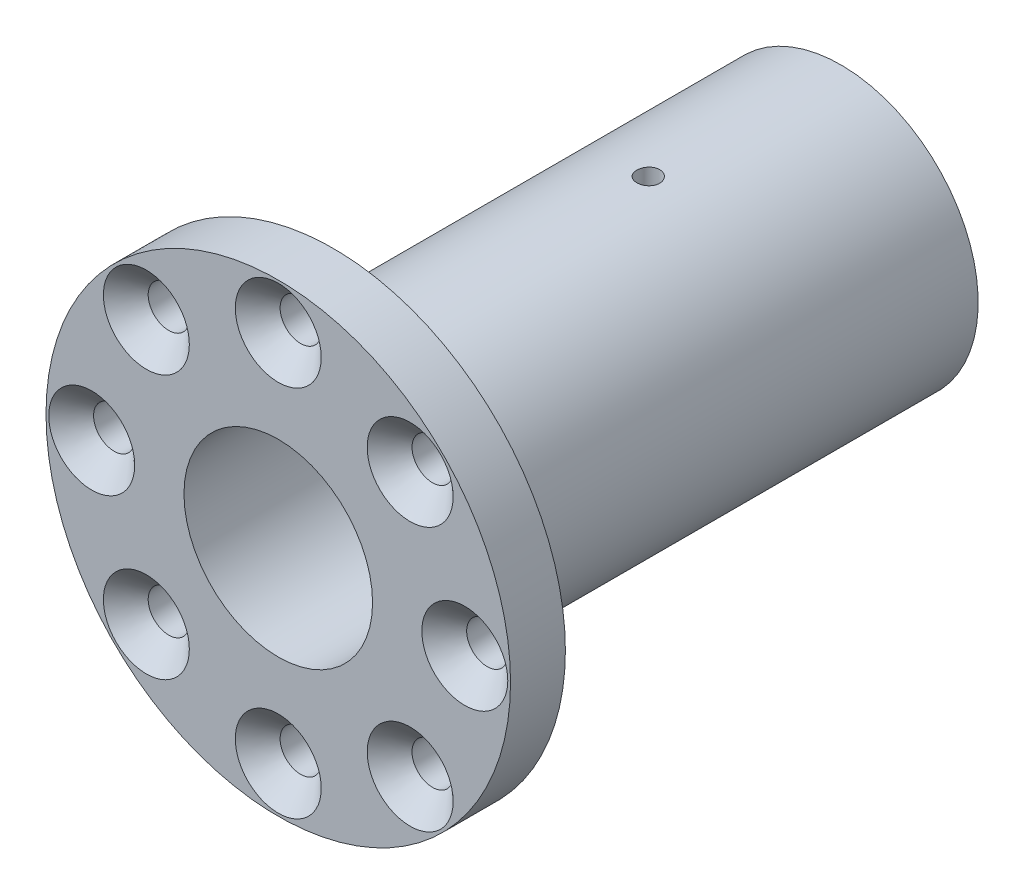
ISO-10303-21;
HEADER;
FILE_DESCRIPTION(('STEP AP214'),'2;1');
FILE_NAME('part.step','',(''),(''),'','','');
FILE_SCHEMA(('AUTOMOTIVE_DESIGN { 1 0 10303 214 1 1 1 1 }'));
ENDSEC;
DATA;
#1=APPLICATION_CONTEXT('core data for automotive mechanical design processes');
#2=APPLICATION_PROTOCOL_DEFINITION('international standard','automotive_design',2000,#1);
#3=PRODUCT_CONTEXT('',#1,'mechanical');
#4=PRODUCT('Part','Part','',(#3));
#5=PRODUCT_RELATED_PRODUCT_CATEGORY('part','',(#4));
#6=PRODUCT_DEFINITION_FORMATION('','',#4);
#7=PRODUCT_DEFINITION_CONTEXT('part definition',#1,'design');
#8=PRODUCT_DEFINITION('design','',#6,#7);
#9=PRODUCT_DEFINITION_SHAPE('','',#8);
#10=(LENGTH_UNIT() NAMED_UNIT(*) SI_UNIT(.MILLI.,.METRE.));
#11=(NAMED_UNIT(*) PLANE_ANGLE_UNIT() SI_UNIT($,.RADIAN.));
#12=(NAMED_UNIT(*) SI_UNIT($,.STERADIAN.) SOLID_ANGLE_UNIT());
#13=UNCERTAINTY_MEASURE_WITH_UNIT(LENGTH_MEASURE(1.E-05),#10,'distance_accuracy_value','');
#14=(GEOMETRIC_REPRESENTATION_CONTEXT(3) GLOBAL_UNCERTAINTY_ASSIGNED_CONTEXT((#13)) GLOBAL_UNIT_ASSIGNED_CONTEXT((#10,
#11,#12)) REPRESENTATION_CONTEXT('',''));
#15=CARTESIAN_POINT('',(0.,0.,0.));
#16=DIRECTION('',(0.,0.,1.));
#17=DIRECTION('',(1.,0.,0.));
#18=AXIS2_PLACEMENT_3D('',#15,#16,#17);
#19=CARTESIAN_POINT('',(-2.5,6.53834841531101,61.54));
#20=DIRECTION('',(-1.,0.,0.));
#21=DIRECTION('',(0.,0.,1.));
#22=AXIS2_PLACEMENT_3D('',#19,#20,#21);
#23=PLANE('',#22);
#24=DIRECTION('',(0.,1.,0.));
#25=VECTOR('',#24,1.);
#26=CARTESIAN_POINT('',(-2.5,6.53834841531101,23.44));
#27=LINE('',#26,#25);
#28=CARTESIAN_POINT('',(-2.5,6.54948151841044,23.44));
#29=VERTEX_POINT('',#28);
#30=CARTESIAN_POINT('',(-2.5,9.05849989544415,23.44));
#31=VERTEX_POINT('',#30);
#32=EDGE_CURVE('E76',#29,#31,#27,.T.);
#33=ORIENTED_EDGE('',*,*,#32,.F.);
#34=DIRECTION('',(0.,0.,-1.));
#35=VECTOR('',#34,1.);
#36=CARTESIAN_POINT('',(-2.5,6.54948151841044,61.54));
#37=LINE('',#36,#35);
#38=CARTESIAN_POINT('',(-2.5,6.54948151841044,0.));
#39=VERTEX_POINT('',#38);
#40=EDGE_CURVE('E81',#29,#39,#37,.T.);
#41=ORIENTED_EDGE('',*,*,#40,.T.);
#42=DIRECTION('',(0.,1.,0.));
#43=VECTOR('',#42,1.);
#44=CARTESIAN_POINT('',(-2.5,6.53834841531101,0.));
#45=LINE('',#44,#43);
#46=CARTESIAN_POINT('',(-2.5,9.05849989544415,0.));
#47=VERTEX_POINT('',#46);
#48=EDGE_CURVE('E89',#39,#47,#45,.T.);
#49=ORIENTED_EDGE('',*,*,#48,.T.);
#50=DIRECTION('',(0.,0.,-1.));
#51=VECTOR('',#50,1.);
#52=CARTESIAN_POINT('',(-2.5,9.05849989544415,61.54));
#53=LINE('',#52,#51);
#54=EDGE_CURVE('E57',#31,#47,#53,.T.);
#55=ORIENTED_EDGE('',*,*,#54,.F.);
#56=EDGE_LOOP('',(#33,#41,#49,#55));
#57=FACE_BOUND('',#56,.T.);
#58=ADVANCED_FACE('F35',(#57),#23,.F.);
#59=CARTESIAN_POINT('',(2.5,9.05849989544415,61.54));
#60=DIRECTION('',(1.,0.,0.));
#61=DIRECTION('',(0.,1.,0.));
#62=AXIS2_PLACEMENT_3D('',#59,#60,#61);
#63=PLANE('',#62);
#64=DIRECTION('',(0.,-1.,0.));
#65=VECTOR('',#64,1.);
#66=CARTESIAN_POINT('',(2.5,9.05849989544415,23.44));
#67=LINE('',#66,#65);
#68=CARTESIAN_POINT('',(2.5,9.05849989544415,23.44));
#69=VERTEX_POINT('',#68);
#70=CARTESIAN_POINT('',(2.5,6.54948151841044,23.44));
#71=VERTEX_POINT('',#70);
#72=EDGE_CURVE('E49',#69,#71,#67,.T.);
#73=ORIENTED_EDGE('',*,*,#72,.F.);
#74=DIRECTION('',(0.,0.,-1.));
#75=VECTOR('',#74,1.);
#76=CARTESIAN_POINT('',(2.5,9.05849989544415,61.54));
#77=LINE('',#76,#75);
#78=CARTESIAN_POINT('',(2.5,9.05849989544415,0.));
#79=VERTEX_POINT('',#78);
#80=EDGE_CURVE('E101',#69,#79,#77,.T.);
#81=ORIENTED_EDGE('',*,*,#80,.T.);
#82=DIRECTION('',(0.,-1.,0.));
#83=VECTOR('',#82,1.);
#84=CARTESIAN_POINT('',(2.5,9.05849989544415,0.));
#85=LINE('',#84,#83);
#86=CARTESIAN_POINT('',(2.5,6.54948151841044,0.));
#87=VERTEX_POINT('',#86);
#88=EDGE_CURVE('E98',#79,#87,#85,.T.);
#89=ORIENTED_EDGE('',*,*,#88,.T.);
#90=DIRECTION('',(0.,0.,-1.));
#91=VECTOR('',#90,1.);
#92=CARTESIAN_POINT('',(2.5,6.54948151841044,61.54));
#93=LINE('',#92,#91);
#94=EDGE_CURVE('E43',#87,#71,#93,.F.);
#95=ORIENTED_EDGE('',*,*,#94,.T.);
#96=EDGE_LOOP('',(#73,#81,#89,#95));
#97=FACE_BOUND('',#96,.T.);
#98=ADVANCED_FACE('F192',(#97),#63,.F.);
#99=CARTESIAN_POINT('',(-2.5,9.05849989544415,61.54));
#100=DIRECTION('',(0.,1.,0.));
#101=DIRECTION('',(0.,0.,1.));
#102=AXIS2_PLACEMENT_3D('',#99,#100,#101);
#103=PLANE('',#102);
#104=CARTESIAN_POINT('',(0.,9.05849989544415,21.082));
#105=DIRECTION('',(0.,-1.,0.));
#106=DIRECTION('',(0.,0.,-1.));
#107=AXIS2_PLACEMENT_3D('',#104,#105,#106);
#108=CIRCLE('',#107,1.24999999999999);
#109=CARTESIAN_POINT('',(0.,9.05849989544415,19.832));
#110=VERTEX_POINT('',#109);
#111=EDGE_CURVE('E125',#110,#110,#108,.T.);
#112=ORIENTED_EDGE('',*,*,#111,.F.);
#113=EDGE_LOOP('',(#112));
#114=FACE_BOUND('',#113,.T.);
#115=DIRECTION('',(1.,0.,0.));
#116=VECTOR('',#115,1.);
#117=CARTESIAN_POINT('',(-2.5,9.05849989544415,23.44));
#118=LINE('',#117,#116);
#119=EDGE_CURVE('E83',#31,#69,#118,.T.);
#120=ORIENTED_EDGE('',*,*,#119,.F.);
#121=ORIENTED_EDGE('',*,*,#54,.T.);
#122=DIRECTION('',(1.,0.,0.));
#123=VECTOR('',#122,1.);
#124=CARTESIAN_POINT('',(-2.5,9.05849989544415,0.));
#125=LINE('',#124,#123);
#126=EDGE_CURVE('E91',#47,#79,#125,.T.);
#127=ORIENTED_EDGE('',*,*,#126,.T.);
#128=ORIENTED_EDGE('',*,*,#80,.F.);
#129=EDGE_LOOP('',(#120,#121,#127,#128));
#130=FACE_BOUND('',#129,.T.);
#131=ADVANCED_FACE('F191',(#114,#130),#103,.F.);
#132=CARTESIAN_POINT('',(0.,0.,61.54));
#133=DIRECTION('',(0.,0.,-1.));
#134=DIRECTION('',(-1.,0.,0.));
#135=AXIS2_PLACEMENT_3D('',#132,#133,#134);
#136=CYLINDRICAL_SURFACE('',#135,7.01039999999999);
#137=CARTESIAN_POINT('',(0.,0.,23.44));
#138=DIRECTION('',(0.,0.,1.));
#139=DIRECTION('',(1.,0.,0.));
#140=AXIS2_PLACEMENT_3D('',#137,#138,#139);
#141=CIRCLE('',#140,7.01039999999999);
#142=EDGE_CURVE('E11',#71,#29,#141,.F.);
#143=ORIENTED_EDGE('',*,*,#142,.F.);
#144=ORIENTED_EDGE('',*,*,#94,.F.);
#145=CARTESIAN_POINT('',(0.,0.,0.));
#146=DIRECTION('',(0.,0.,-1.));
#147=DIRECTION('',(-1.,0.,0.));
#148=AXIS2_PLACEMENT_3D('',#145,#146,#147);
#149=CIRCLE('',#148,7.01039999999999);
#150=EDGE_CURVE('E87',#87,#39,#149,.T.);
#151=ORIENTED_EDGE('',*,*,#150,.T.);
#152=ORIENTED_EDGE('',*,*,#40,.F.);
#153=EDGE_LOOP('',(#143,#144,#151,#152));
#154=FACE_BOUND('',#153,.T.);
#155=ADVANCED_FACE('F85',(#154),#136,.F.);
#156=CARTESIAN_POINT('',(0.,0.,61.54));
#157=DIRECTION('',(0.,0.,-1.));
#158=DIRECTION('',(-1.,0.,0.));
#159=AXIS2_PLACEMENT_3D('',#156,#157,#158);
#160=CYLINDRICAL_SURFACE('',#159,25.4);
#161=CARTESIAN_POINT('',(0.,0.,61.54));
#162=DIRECTION('',(0.,0.,-1.));
#163=DIRECTION('',(-1.,0.,0.));
#164=AXIS2_PLACEMENT_3D('',#161,#162,#163);
#165=CIRCLE('',#164,25.4);
#166=CARTESIAN_POINT('',(-25.4,0.,61.54));
#167=VERTEX_POINT('',#166);
#168=EDGE_CURVE('E113',#167,#167,#165,.T.);
#169=ORIENTED_EDGE('',*,*,#168,.T.);
#170=EDGE_LOOP('',(#169));
#171=FACE_BOUND('',#170,.T.);
#172=CARTESIAN_POINT('',(0.,0.,55.54));
#173=DIRECTION('',(0.,0.,-1.));
#174=DIRECTION('',(-1.,0.,0.));
#175=AXIS2_PLACEMENT_3D('',#172,#173,#174);
#176=CIRCLE('',#175,25.4);
#177=CARTESIAN_POINT('',(-25.4,0.,55.54));
#178=VERTEX_POINT('',#177);
#179=EDGE_CURVE('E108',#178,#178,#176,.T.);
#180=ORIENTED_EDGE('',*,*,#179,.F.);
#181=EDGE_LOOP('',(#180));
#182=FACE_BOUND('',#181,.T.);
#183=ADVANCED_FACE('F37',(#171,#182),#160,.T.);
#184=CARTESIAN_POINT('',(25.4,0.,61.54));
#185=DIRECTION('',(0.,0.,1.));
#186=DIRECTION('',(1.,0.,0.));
#187=AXIS2_PLACEMENT_3D('',#184,#185,#186);
#188=PLANE('',#187);
#189=CARTESIAN_POINT('',(0.,0.,61.54));
#190=DIRECTION('',(0.,0.,1.));
#191=DIRECTION('',(1.,0.,0.));
#192=AXIS2_PLACEMENT_3D('',#189,#190,#191);
#193=CIRCLE('',#192,10.3124);
#194=CARTESIAN_POINT('',(10.3124,0.,61.54));
#195=VERTEX_POINT('',#194);
#196=EDGE_CURVE('E256',#195,#195,#193,.T.);
#197=ORIENTED_EDGE('',*,*,#196,.F.);
#198=EDGE_LOOP('',(#197));
#199=FACE_BOUND('',#198,.T.);
#200=CARTESIAN_POINT('',(0.,20.4,61.54));
#201=DIRECTION('',(0.,0.,1.));
#202=DIRECTION('',(1.,0.,0.));
#203=AXIS2_PLACEMENT_3D('',#200,#201,#202);
#204=CIRCLE('',#203,4.70000000001392);
#205=CARTESIAN_POINT('',(4.70000000001392,20.4,61.54));
#206=VERTEX_POINT('',#205);
#207=EDGE_CURVE('E260',#206,#206,#204,.T.);
#208=ORIENTED_EDGE('',*,*,#207,.F.);
#209=EDGE_LOOP('',(#208));
#210=FACE_BOUND('',#209,.T.);
#211=CARTESIAN_POINT('',(14.4249783362061,14.4249783362068,61.54));
#212=DIRECTION('',(0.,0.,1.));
#213=DIRECTION('',(1.,0.,0.));
#214=AXIS2_PLACEMENT_3D('',#211,#212,#213);
#215=CIRCLE('',#214,4.70000000001391);
#216=CARTESIAN_POINT('',(19.12497833622,14.4249783362068,61.54));
#217=VERTEX_POINT('',#216);
#218=EDGE_CURVE('E264',#217,#217,#215,.T.);
#219=ORIENTED_EDGE('',*,*,#218,.F.);
#220=EDGE_LOOP('',(#219));
#221=FACE_BOUND('',#220,.T.);
#222=CARTESIAN_POINT('',(20.4000000000017,1.73691033767046E-12,61.54));
#223=DIRECTION('',(0.,0.,1.));
#224=DIRECTION('',(1.,0.,0.));
#225=AXIS2_PLACEMENT_3D('',#222,#223,#224);
#226=CIRCLE('',#225,4.70000000001392);
#227=CARTESIAN_POINT('',(25.1000000000156,1.73691033767046E-12,61.54));
#228=VERTEX_POINT('',#227);
#229=EDGE_CURVE('E268',#228,#228,#226,.T.);
#230=ORIENTED_EDGE('',*,*,#229,.F.);
#231=EDGE_LOOP('',(#230));
#232=FACE_BOUND('',#231,.T.);
#233=CARTESIAN_POINT('',(14.4249783362085,-14.4249783362043,61.54));
#234=DIRECTION('',(0.,0.,1.));
#235=DIRECTION('',(1.,0.,0.));
#236=AXIS2_PLACEMENT_3D('',#233,#234,#235);
#237=CIRCLE('',#236,4.70000000001392);
#238=CARTESIAN_POINT('',(19.1249783362224,-14.4249783362043,61.54));
#239=VERTEX_POINT('',#238);
#240=EDGE_CURVE('E272',#239,#239,#237,.T.);
#241=ORIENTED_EDGE('',*,*,#240,.F.);
#242=EDGE_LOOP('',(#241));
#243=FACE_BOUND('',#242,.T.);
#244=CARTESIAN_POINT('',(3.47378376064356E-12,-20.4,61.54));
#245=DIRECTION('',(0.,0.,1.));
#246=DIRECTION('',(1.,0.,0.));
#247=AXIS2_PLACEMENT_3D('',#244,#245,#246);
#248=CIRCLE('',#247,4.70000000001392);
#249=CARTESIAN_POINT('',(4.70000000001739,-20.4,61.54));
#250=VERTEX_POINT('',#249);
#251=EDGE_CURVE('E276',#250,#250,#248,.T.);
#252=ORIENTED_EDGE('',*,*,#251,.F.);
#253=EDGE_LOOP('',(#252));
#254=FACE_BOUND('',#253,.T.);
#255=CARTESIAN_POINT('',(-14.4249783362026,-14.4249783362068,61.54));
#256=DIRECTION('',(0.,0.,1.));
#257=DIRECTION('',(1.,0.,0.));
#258=AXIS2_PLACEMENT_3D('',#255,#256,#257);
#259=CIRCLE('',#258,4.70000000001392);
#260=CARTESIAN_POINT('',(-9.72497833618869,-14.4249783362068,61.54));
#261=VERTEX_POINT('',#260);
#262=EDGE_CURVE('E280',#261,#261,#259,.T.);
#263=ORIENTED_EDGE('',*,*,#262,.F.);
#264=EDGE_LOOP('',(#263));
#265=FACE_BOUND('',#264,.T.);
#266=CARTESIAN_POINT('',(-20.3999999999983,-1.73940861714072E-12,61.54));
#267=DIRECTION('',(0.,0.,1.));
#268=DIRECTION('',(1.,0.,0.));
#269=AXIS2_PLACEMENT_3D('',#266,#267,#268);
#270=CIRCLE('',#269,4.70000000001392);
#271=CARTESIAN_POINT('',(-15.6999999999844,-1.73940861714072E-12,61.54));
#272=VERTEX_POINT('',#271);
#273=EDGE_CURVE('E284',#272,#272,#270,.T.);
#274=ORIENTED_EDGE('',*,*,#273,.F.);
#275=EDGE_LOOP('',(#274));
#276=FACE_BOUND('',#275,.T.);
#277=CARTESIAN_POINT('',(-14.4249783362051,14.4249783362043,61.54));
#278=DIRECTION('',(0.,0.,1.));
#279=DIRECTION('',(1.,0.,0.));
#280=AXIS2_PLACEMENT_3D('',#277,#278,#279);
#281=CIRCLE('',#280,4.70000000001392);
#282=CARTESIAN_POINT('',(-9.72497833619114,14.4249783362043,61.54));
#283=VERTEX_POINT('',#282);
#284=EDGE_CURVE('E287',#283,#283,#281,.T.);
#285=ORIENTED_EDGE('',*,*,#284,.F.);
#286=EDGE_LOOP('',(#285));
#287=FACE_BOUND('',#286,.T.);
#288=ORIENTED_EDGE('',*,*,#168,.F.);
#289=EDGE_LOOP('',(#288));
#290=FACE_BOUND('',#289,.T.);
#291=ADVANCED_FACE('F239',(#199,#210,#221,#232,#243,#254,#265,#276,#287,#290),#188,.T.);
#292=CARTESIAN_POINT('',(0.,0.,55.54));
#293=DIRECTION('',(0.,0.,-1.));
#294=DIRECTION('',(-1.,0.,0.));
#295=AXIS2_PLACEMENT_3D('',#292,#293,#294);
#296=PLANE('',#295);
#297=CARTESIAN_POINT('',(0.,20.4,55.54));
#298=DIRECTION('',(0.,0.,-1.));
#299=DIRECTION('',(-1.,0.,0.));
#300=AXIS2_PLACEMENT_3D('',#297,#298,#299);
#301=CIRCLE('',#300,2.24999999999998);
#302=CARTESIAN_POINT('',(-2.24999999999998,20.4,55.54));
#303=VERTEX_POINT('',#302);
#304=EDGE_CURVE('E424',#303,#303,#301,.T.);
#305=ORIENTED_EDGE('',*,*,#304,.F.);
#306=EDGE_LOOP('',(#305));
#307=FACE_BOUND('',#306,.T.);
#308=CARTESIAN_POINT('',(14.4249783362061,14.4249783362068,55.54));
#309=DIRECTION('',(0.,0.,-1.));
#310=DIRECTION('',(-1.,0.,0.));
#311=AXIS2_PLACEMENT_3D('',#308,#309,#310);
#312=CIRCLE('',#311,2.24999999999998);
#313=CARTESIAN_POINT('',(12.1749783362061,14.4249783362068,55.54));
#314=VERTEX_POINT('',#313);
#315=EDGE_CURVE('E429',#314,#314,#312,.T.);
#316=ORIENTED_EDGE('',*,*,#315,.F.);
#317=EDGE_LOOP('',(#316));
#318=FACE_BOUND('',#317,.T.);
#319=CARTESIAN_POINT('',(20.4000000000017,1.73691033767046E-12,55.54));
#320=DIRECTION('',(0.,0.,-1.));
#321=DIRECTION('',(-1.,0.,0.));
#322=AXIS2_PLACEMENT_3D('',#319,#320,#321);
#323=CIRCLE('',#322,2.24999999999998);
#324=CARTESIAN_POINT('',(18.1500000000018,1.73691033767046E-12,55.54));
#325=VERTEX_POINT('',#324);
#326=EDGE_CURVE('E434',#325,#325,#323,.T.);
#327=ORIENTED_EDGE('',*,*,#326,.F.);
#328=EDGE_LOOP('',(#327));
#329=FACE_BOUND('',#328,.T.);
#330=CARTESIAN_POINT('',(14.4249783362085,-14.4249783362043,55.54));
#331=DIRECTION('',(0.,0.,-1.));
#332=DIRECTION('',(-1.,0.,0.));
#333=AXIS2_PLACEMENT_3D('',#330,#331,#332);
#334=CIRCLE('',#333,2.24999999999998);
#335=CARTESIAN_POINT('',(12.1749783362086,-14.4249783362043,55.54));
#336=VERTEX_POINT('',#335);
#337=EDGE_CURVE('E439',#336,#336,#334,.T.);
#338=ORIENTED_EDGE('',*,*,#337,.F.);
#339=EDGE_LOOP('',(#338));
#340=FACE_BOUND('',#339,.T.);
#341=CARTESIAN_POINT('',(3.47378376064356E-12,-20.4,55.54));
#342=DIRECTION('',(0.,0.,-1.));
#343=DIRECTION('',(-1.,0.,0.));
#344=AXIS2_PLACEMENT_3D('',#341,#342,#343);
#345=CIRCLE('',#344,2.24999999999998);
#346=CARTESIAN_POINT('',(-2.2499999999965,-20.4,55.54));
#347=VERTEX_POINT('',#346);
#348=EDGE_CURVE('E444',#347,#347,#345,.T.);
#349=ORIENTED_EDGE('',*,*,#348,.F.);
#350=EDGE_LOOP('',(#349));
#351=FACE_BOUND('',#350,.T.);
#352=CARTESIAN_POINT('',(-14.4249783362026,-14.4249783362068,55.54));
#353=DIRECTION('',(0.,0.,-1.));
#354=DIRECTION('',(-1.,0.,0.));
#355=AXIS2_PLACEMENT_3D('',#352,#353,#354);
#356=CIRCLE('',#355,2.24999999999998);
#357=CARTESIAN_POINT('',(-16.6749783362026,-14.4249783362068,55.54));
#358=VERTEX_POINT('',#357);
#359=EDGE_CURVE('E448',#358,#358,#356,.T.);
#360=ORIENTED_EDGE('',*,*,#359,.F.);
#361=EDGE_LOOP('',(#360));
#362=FACE_BOUND('',#361,.T.);
#363=CARTESIAN_POINT('',(-20.3999999999983,-1.73940861714072E-12,55.54));
#364=DIRECTION('',(0.,0.,-1.));
#365=DIRECTION('',(-1.,0.,0.));
#366=AXIS2_PLACEMENT_3D('',#363,#364,#365);
#367=CIRCLE('',#366,2.24999999999998);
#368=CARTESIAN_POINT('',(-22.6499999999982,-1.73940861714072E-12,55.54));
#369=VERTEX_POINT('',#368);
#370=EDGE_CURVE('E290',#369,#369,#367,.T.);
#371=ORIENTED_EDGE('',*,*,#370,.F.);
#372=EDGE_LOOP('',(#371));
#373=FACE_BOUND('',#372,.T.);
#374=CARTESIAN_POINT('',(-14.4249783362051,14.4249783362043,55.54));
#375=DIRECTION('',(0.,0.,-1.));
#376=DIRECTION('',(-1.,0.,0.));
#377=AXIS2_PLACEMENT_3D('',#374,#375,#376);
#378=CIRCLE('',#377,2.24999999999998);
#379=CARTESIAN_POINT('',(-16.674978336205,14.4249783362043,55.54));
#380=VERTEX_POINT('',#379);
#381=EDGE_CURVE('E126',#380,#380,#378,.T.);
#382=ORIENTED_EDGE('',*,*,#381,.F.);
#383=EDGE_LOOP('',(#382));
#384=FACE_BOUND('',#383,.T.);
#385=CARTESIAN_POINT('',(0.,0.,55.54));
#386=DIRECTION('',(0.,0.,-1.));
#387=DIRECTION('',(-1.,0.,0.));
#388=AXIS2_PLACEMENT_3D('',#385,#386,#387);
#389=CIRCLE('',#388,15.);
#390=CARTESIAN_POINT('',(-15.,0.,55.54));
#391=VERTEX_POINT('',#390);
#392=EDGE_CURVE('E103',#391,#391,#389,.T.);
#393=ORIENTED_EDGE('',*,*,#392,.F.);
#394=EDGE_LOOP('',(#393));
#395=FACE_BOUND('',#394,.T.);
#396=ORIENTED_EDGE('',*,*,#179,.T.);
#397=EDGE_LOOP('',(#396));
#398=FACE_BOUND('',#397,.T.);
#399=ADVANCED_FACE('F205',(#307,#318,#329,#340,#351,#362,#373,#384,#395,#398),#296,.T.);
#400=CARTESIAN_POINT('',(0.,0.,0.));
#401=DIRECTION('',(0.,0.,1.));
#402=DIRECTION('',(1.,0.,0.));
#403=AXIS2_PLACEMENT_3D('',#400,#401,#402);
#404=CYLINDRICAL_SURFACE('',#403,15.);
#405=CARTESIAN_POINT('',(0.,15.,19.832));
#406=CARTESIAN_POINT('',(0.0700826124015046,14.999999317644,19.8320030610329));
#407=CARTESIAN_POINT('',(0.140212933975281,14.9995036067925,19.8379137122638));
#408=CARTESIAN_POINT('',(0.278533213375484,14.9975737791031,19.8614054398189));
#409=CARTESIAN_POINT('',(0.346720881531534,14.9961385991462,19.8789997378811));
#410=CARTESIAN_POINT('',(0.479132528142821,14.9924920155763,19.9253464422617));
#411=CARTESIAN_POINT('',(0.543358725530763,14.9902810512311,19.9540925351373));
#412=CARTESIAN_POINT('',(0.666059041770088,14.9853308468089,20.02191553984));
#413=CARTESIAN_POINT('',(0.724534387356729,14.982591719767,20.0609902418469));
#414=CARTESIAN_POINT('',(0.83423749995698,14.9768847483339,20.1484688332575));
#415=CARTESIAN_POINT('',(0.885448590520192,14.9739164010822,20.1968936049196));
#416=CARTESIAN_POINT('',(0.979026416920682,14.9680897600396,20.3016536198124));
#417=CARTESIAN_POINT('',(1.02139276421437,14.965231471088,20.3579892103783));
#418=CARTESIAN_POINT('',(1.09613490298778,14.9599431582655,20.4770726463738));
#419=CARTESIAN_POINT('',(1.12849604118942,14.9575137647512,20.5398297192535));
#420=CARTESIAN_POINT('',(1.18221554221729,14.9533640556034,20.669910369445));
#421=CARTESIAN_POINT('',(1.20357409939051,14.9516437274454,20.7372338660728));
#422=CARTESIAN_POINT('',(1.2346337872732,14.949111150829,20.8743692398515));
#423=CARTESIAN_POINT('',(1.24436208173721,14.9482967867028,20.9441749249908));
#424=CARTESIAN_POINT('',(1.25196901001927,14.9476616540185,21.0844327549317));
#425=CARTESIAN_POINT('',(1.24984786622441,14.9478408668133,21.1548848875763));
#426=CARTESIAN_POINT('',(1.23383858026855,14.9491707170205,21.2942495818882));
#427=CARTESIAN_POINT('',(1.21997996004756,14.9503189172232,21.3631655613455));
#428=CARTESIAN_POINT('',(1.18093498172866,14.9534535446171,21.4976898342412));
#429=CARTESIAN_POINT('',(1.15574851299597,14.955439979995,21.5632980953673));
#430=CARTESIAN_POINT('',(1.09472973519003,14.9600300588357,21.6894386323476));
#431=CARTESIAN_POINT('',(1.05888418094648,14.9626344693871,21.7499644719844));
#432=CARTESIAN_POINT('',(0.977574304891675,14.9681663357985,21.8641516735248));
#433=CARTESIAN_POINT('',(0.932109788278167,14.9710937982004,21.9178128963715));
#434=CARTESIAN_POINT('',(0.832686977782944,14.9769527551456,22.0169192741019));
#435=CARTESIAN_POINT('',(0.77870316173821,14.9798842346883,22.0623388301616));
#436=CARTESIAN_POINT('',(0.663863195464681,14.9854123983729,22.1434746542357));
#437=CARTESIAN_POINT('',(0.603007040644165,14.9880090822911,22.1791909157669));
#438=CARTESIAN_POINT('',(0.476133241584809,14.9925755726205,22.2399047033359));
#439=CARTESIAN_POINT('',(0.410115052261338,14.9945453127181,22.2649010955977));
#440=CARTESIAN_POINT('',(0.274798836274474,14.9976352176475,22.3034476655641));
#441=CARTESIAN_POINT('',(0.205500877711066,14.9987554001111,22.3169980808191));
#442=CARTESIAN_POINT('',(0.0658141252053123,15.0000177117881,22.332235955052));
#443=CARTESIAN_POINT('',(-0.0045707863939955,15.00016275615,22.3339587726336));
#444=CARTESIAN_POINT('',(-0.144628440629128,14.9994662347338,22.3255851742158));
#445=CARTESIAN_POINT('',(-0.214301189901765,14.9986246781584,22.3154888684632));
#446=CARTESIAN_POINT('',(-0.350855945280871,14.9960514730165,22.2837929267374));
#447=CARTESIAN_POINT('',(-0.417741781424648,14.9943210927178,22.2622096799677));
#448=CARTESIAN_POINT('',(-0.546942706353105,14.9901646264044,22.2081692652724));
#449=CARTESIAN_POINT('',(-0.609257722853909,14.9877385293905,22.1757119254269));
#450=CARTESIAN_POINT('',(-0.727709022877376,14.9824553299204,22.1007558134795));
#451=CARTESIAN_POINT('',(-0.783830438151828,14.9795972277342,22.0582336170065));
#452=CARTESIAN_POINT('',(-0.888151368554517,14.9737744829962,21.9643886786869));
#453=CARTESIAN_POINT('',(-0.93635074601797,14.9708098385941,21.9130657839384));
#454=CARTESIAN_POINT('',(-1.02358068181887,14.9650995151978,21.8029228847521));
#455=CARTESIAN_POINT('',(-1.06258816654204,14.9623543984278,21.7440845735032));
#456=CARTESIAN_POINT('',(-1.13016882854939,14.957401896804,21.6206721714207));
#457=CARTESIAN_POINT('',(-1.15874211001244,14.9551945065815,21.5560981378626));
#458=CARTESIAN_POINT('',(-1.20460397180069,14.9515705356118,21.4231290118259));
#459=CARTESIAN_POINT('',(-1.2219066768116,14.9501529653579,21.3547388191071));
#460=CARTESIAN_POINT('',(-1.24478221238768,14.9482658211357,21.216011625157));
#461=CARTESIAN_POINT('',(-1.25035526821032,14.9477962289621,21.145674661338));
#462=CARTESIAN_POINT('',(-1.24961070361365,14.9478584743774,21.0052798424739));
#463=CARTESIAN_POINT('',(-1.24332933722173,14.9483872586634,20.9352217909545));
#464=CARTESIAN_POINT('',(-1.21912982911878,14.9503801885288,20.7971593330614));
#465=CARTESIAN_POINT('',(-1.20121166965952,14.951844335535,20.7291549298202));
#466=CARTESIAN_POINT('',(-1.15425638752132,14.9555422141463,20.5971277959167));
#467=CARTESIAN_POINT('',(-1.12521991750816,14.9577759005774,20.5331048317929));
#468=CARTESIAN_POINT('',(-1.05685632368405,14.9627612484384,20.4108364492829));
#469=CARTESIAN_POINT('',(-1.01752936139319,14.9655129017381,20.3525909402333));
#470=CARTESIAN_POINT('',(-0.929564927653049,14.9712341462335,20.2433453262337));
#471=CARTESIAN_POINT('',(-0.880900617176813,14.9742043500718,20.1923668641783));
#472=CARTESIAN_POINT('',(-0.775691531990572,14.980022437621,20.0992810184959));
#473=CARTESIAN_POINT('',(-0.719144853301355,14.9828702915603,20.05717578438));
#474=CARTESIAN_POINT('',(-0.59966721628676,14.9881279355284,19.9829751744781));
#475=CARTESIAN_POINT('',(-0.536724570338166,14.9905369002888,19.9508985766796));
#476=CARTESIAN_POINT('',(-0.406369689994662,14.9946356564538,19.8978102461859));
#477=CARTESIAN_POINT('',(-0.33896269426706,14.9963262741032,19.8767857946399));
#478=CARTESIAN_POINT('',(-0.225965060120847,14.9983638466732,19.8517530218725));
#479=CARTESIAN_POINT('',(-0.181101118048087,14.9989746109619,19.8443554843532));
#480=CARTESIAN_POINT('',(-0.0908314643764523,14.9997929082329,19.8344779879035));
#481=CARTESIAN_POINT('',(-0.0454257542163059,15.0000004422857,19.8319980159169));
#482=CARTESIAN_POINT('',(0.,15.,19.832));
#483=B_SPLINE_CURVE_WITH_KNOTS('',3,(#405,#406,#407,#408,#409,#410,#411,#412,#413,#414,#415,
#416,#417,#418,#419,#420,#421,#422,#423,#424,#425,#426,#427,#428,#429,#430,#431,#432,#433,#434,
#435,#436,#437,#438,#439,#440,#441,#442,#443,#444,#445,#446,#447,#448,#449,#450,#451,#452,#453,
#454,#455,#456,#457,#458,#459,#460,#461,#462,#463,#464,#465,#466,#467,#468,#469,#470,#471,#472,
#473,#474,#475,#476,#477,#478,#479,#480,#481,#482),.UNSPECIFIED.,.T.,.F.,(4,2,2,2,2,2,2,2,2,2,2,
2,2,2,2,2,2,2,2,2,2,2,2,2,2,2,2,2,2,2,2,2,2,2,2,2,2,2,4),(0.,0.210081983500172,0.42040211124729,
0.630603342361185,0.840759636980218,1.05139083598219,1.26203128592413,1.47297878688863,
1.68392256159874,1.89437268539481,2.10481885953272,2.3147372888786,2.52465776846246,
2.73484019686122,2.94502688226072,3.15585563668934,3.36668453198303,3.57753571988059,
3.78838253165665,3.99859874133957,4.20881299017772,4.41872811288477,4.62864655451711,
4.83905843718653,5.04947397589058,5.26041220613997,5.4713483302478,5.68201959051155,
5.89268680498441,6.10271078603153,6.31273508740418,6.52274706184397,6.73275574012314,
6.94337735830792,7.15404994040594,7.36511466328185,7.57593595739724,7.7121060794582,
7.84827583998425),.UNSPECIFIED.);
#484=CARTESIAN_POINT('',(0.,15.,19.832));
#485=VERTEX_POINT('',#484);
#486=EDGE_CURVE('E117',#485,#485,#483,.T.);
#487=ORIENTED_EDGE('',*,*,#486,.T.);
#488=EDGE_LOOP('',(#487));
#489=FACE_BOUND('',#488,.T.);
#490=CARTESIAN_POINT('',(0.,0.,0.));
#491=DIRECTION('',(0.,0.,-1.));
#492=DIRECTION('',(-1.,0.,0.));
#493=AXIS2_PLACEMENT_3D('',#490,#491,#492);
#494=CIRCLE('',#493,15.);
#495=CARTESIAN_POINT('',(-15.,0.,0.));
#496=VERTEX_POINT('',#495);
#497=EDGE_CURVE('E105',#496,#496,#494,.T.);
#498=ORIENTED_EDGE('',*,*,#497,.F.);
#499=EDGE_LOOP('',(#498));
#500=FACE_BOUND('',#499,.T.);
#501=ORIENTED_EDGE('',*,*,#392,.T.);
#502=EDGE_LOOP('',(#501));
#503=FACE_BOUND('',#502,.T.);
#504=ADVANCED_FACE('F128',(#489,#500,#503),#404,.T.);
#505=CARTESIAN_POINT('',(0.,0.,0.));
#506=DIRECTION('',(0.,0.,-1.));
#507=DIRECTION('',(-1.,0.,0.));
#508=AXIS2_PLACEMENT_3D('',#505,#506,#507);
#509=PLANE('',#508);
#510=CARTESIAN_POINT('',(11.4999999999991,-7.61616736356426E-13,0.));
#511=DIRECTION('',(0.,0.,-1.));
#512=DIRECTION('',(-1.,0.,0.));
#513=AXIS2_PLACEMENT_3D('',#510,#511,#512);
#514=CIRCLE('',#513,1.24999999999999);
#515=CARTESIAN_POINT('',(10.2499999999991,-7.61616736356426E-13,0.));
#516=VERTEX_POINT('',#515);
#517=EDGE_CURVE('E124',#516,#516,#514,.T.);
#518=ORIENTED_EDGE('',*,*,#517,.F.);
#519=EDGE_LOOP('',(#518));
#520=FACE_BOUND('',#519,.T.);
#521=CARTESIAN_POINT('',(5.74999999999794,-9.95929214352135,0.));
#522=DIRECTION('',(0.,0.,-1.));
#523=DIRECTION('',(-1.,0.,0.));
#524=AXIS2_PLACEMENT_3D('',#521,#522,#523);
#525=CIRCLE('',#524,1.24999999999999);
#526=CARTESIAN_POINT('',(4.49999999999795,-9.95929214352135,0.));
#527=VERTEX_POINT('',#526);
#528=EDGE_CURVE('E213',#527,#527,#525,.T.);
#529=ORIENTED_EDGE('',*,*,#528,.F.);
#530=EDGE_LOOP('',(#529));
#531=FACE_BOUND('',#530,.T.);
#532=CARTESIAN_POINT('',(-5.75000000000222,-9.95929214352015,0.));
#533=DIRECTION('',(0.,0.,-1.));
#534=DIRECTION('',(-1.,0.,0.));
#535=AXIS2_PLACEMENT_3D('',#532,#533,#534);
#536=CIRCLE('',#535,1.24999999999999);
#537=CARTESIAN_POINT('',(-7.00000000000221,-9.95929214352015,0.));
#538=VERTEX_POINT('',#537);
#539=EDGE_CURVE('E217',#538,#538,#536,.T.);
#540=ORIENTED_EDGE('',*,*,#539,.F.);
#541=EDGE_LOOP('',(#540));
#542=FACE_BOUND('',#541,.T.);
#543=CARTESIAN_POINT('',(-11.5000000000013,1.64225995095778E-12,0.));
#544=DIRECTION('',(0.,0.,-1.));
#545=DIRECTION('',(-1.,0.,0.));
#546=AXIS2_PLACEMENT_3D('',#543,#544,#545);
#547=CIRCLE('',#546,1.24999999999999);
#548=CARTESIAN_POINT('',(-12.7500000000013,1.64225995095778E-12,0.));
#549=VERTEX_POINT('',#548);
#550=EDGE_CURVE('E221',#549,#549,#547,.T.);
#551=ORIENTED_EDGE('',*,*,#550,.F.);
#552=EDGE_LOOP('',(#551));
#553=FACE_BOUND('',#552,.T.);
#554=CARTESIAN_POINT('',(-5.75000000000015,9.95929214352223,0.));
#555=DIRECTION('',(0.,0.,-1.));
#556=DIRECTION('',(-1.,0.,0.));
#557=AXIS2_PLACEMENT_3D('',#554,#555,#556);
#558=CIRCLE('',#557,1.24999999999999);
#559=CARTESIAN_POINT('',(-7.00000000000014,9.95929214352223,0.));
#560=VERTEX_POINT('',#559);
#561=EDGE_CURVE('E225',#560,#560,#558,.T.);
#562=ORIENTED_EDGE('',*,*,#561,.F.);
#563=EDGE_LOOP('',(#562));
#564=FACE_BOUND('',#563,.T.);
#565=CARTESIAN_POINT('',(5.75000000000002,9.95929214352104,0.));
#566=DIRECTION('',(0.,0.,-1.));
#567=DIRECTION('',(-1.,0.,0.));
#568=AXIS2_PLACEMENT_3D('',#565,#566,#567);
#569=CIRCLE('',#568,1.24999999999999);
#570=CARTESIAN_POINT('',(4.50000000000003,9.95929214352104,0.));
#571=VERTEX_POINT('',#570);
#572=EDGE_CURVE('E229',#571,#571,#569,.T.);
#573=ORIENTED_EDGE('',*,*,#572,.F.);
#574=EDGE_LOOP('',(#573));
#575=FACE_BOUND('',#574,.T.);
#576=ORIENTED_EDGE('',*,*,#150,.F.);
#577=ORIENTED_EDGE('',*,*,#88,.F.);
#578=ORIENTED_EDGE('',*,*,#126,.F.);
#579=ORIENTED_EDGE('',*,*,#48,.F.);
#580=EDGE_LOOP('',(#576,#577,#578,#579));
#581=FACE_BOUND('',#580,.T.);
#582=ORIENTED_EDGE('',*,*,#497,.T.);
#583=EDGE_LOOP('',(#582));
#584=FACE_BOUND('',#583,.T.);
#585=ADVANCED_FACE('F187',(#520,#531,#542,#553,#564,#575,#581,#584),#509,.T.);
#586=CARTESIAN_POINT('',(5.75000000000001,9.95929214352104,12.));
#587=DIRECTION('',(0.,0.,1.));
#588=DIRECTION('',(1.,0.,0.));
#589=AXIS2_PLACEMENT_3D('',#586,#587,#588);
#590=PLANE('',#589);
#591=CARTESIAN_POINT('',(5.75000000000002,9.95929214352104,12.));
#592=DIRECTION('',(0.,0.,-1.));
#593=DIRECTION('',(-1.,0.,0.));
#594=AXIS2_PLACEMENT_3D('',#591,#592,#593);
#595=CIRCLE('',#594,1.24999999999999);
#596=CARTESIAN_POINT('',(4.50000000000003,9.95929214352104,12.));
#597=VERTEX_POINT('',#596);
#598=EDGE_CURVE('E93',#597,#597,#595,.T.);
#599=ORIENTED_EDGE('',*,*,#598,.T.);
#600=EDGE_LOOP('',(#599));
#601=FACE_BOUND('',#600,.T.);
#602=ADVANCED_FACE('F183',(#601),#590,.F.);
#603=CARTESIAN_POINT('',(5.75000000000002,9.95929214352104,0.));
#604=DIRECTION('',(0.,0.,-1.));
#605=DIRECTION('',(-1.,0.,0.));
#606=AXIS2_PLACEMENT_3D('',#603,#604,#605);
#607=CYLINDRICAL_SURFACE('',#606,1.24999999999999);
#608=ORIENTED_EDGE('',*,*,#598,.F.);
#609=EDGE_LOOP('',(#608));
#610=FACE_BOUND('',#609,.T.);
#611=ORIENTED_EDGE('',*,*,#572,.T.);
#612=EDGE_LOOP('',(#611));
#613=FACE_BOUND('',#612,.T.);
#614=ADVANCED_FACE('F179',(#610,#613),#607,.F.);
#615=CARTESIAN_POINT('',(-5.75000000000015,9.95929214352223,12.));
#616=DIRECTION('',(0.,0.,1.));
#617=DIRECTION('',(1.,0.,0.));
#618=AXIS2_PLACEMENT_3D('',#615,#616,#617);
#619=PLANE('',#618);
#620=CARTESIAN_POINT('',(-5.75000000000015,9.95929214352223,12.));
#621=DIRECTION('',(0.,0.,-1.));
#622=DIRECTION('',(-1.,0.,0.));
#623=AXIS2_PLACEMENT_3D('',#620,#621,#622);
#624=CIRCLE('',#623,1.24999999999999);
#625=CARTESIAN_POINT('',(-7.00000000000014,9.95929214352223,12.));
#626=VERTEX_POINT('',#625);
#627=EDGE_CURVE('E318',#626,#626,#624,.T.);
#628=ORIENTED_EDGE('',*,*,#627,.T.);
#629=EDGE_LOOP('',(#628));
#630=FACE_BOUND('',#629,.T.);
#631=ADVANCED_FACE('F175',(#630),#619,.F.);
#632=CARTESIAN_POINT('',(-5.75000000000015,9.95929214352223,0.));
#633=DIRECTION('',(0.,0.,-1.));
#634=DIRECTION('',(-1.,0.,0.));
#635=AXIS2_PLACEMENT_3D('',#632,#633,#634);
#636=CYLINDRICAL_SURFACE('',#635,1.24999999999999);
#637=ORIENTED_EDGE('',*,*,#627,.F.);
#638=EDGE_LOOP('',(#637));
#639=FACE_BOUND('',#638,.T.);
#640=ORIENTED_EDGE('',*,*,#561,.T.);
#641=EDGE_LOOP('',(#640));
#642=FACE_BOUND('',#641,.T.);
#643=ADVANCED_FACE('F171',(#639,#642),#636,.F.);
#644=CARTESIAN_POINT('',(-11.5000000000013,1.64225995095778E-12,12.));
#645=DIRECTION('',(0.,0.,1.));
#646=DIRECTION('',(1.,0.,0.));
#647=AXIS2_PLACEMENT_3D('',#644,#645,#646);
#648=PLANE('',#647);
#649=CARTESIAN_POINT('',(-11.5000000000013,1.64225995095778E-12,12.));
#650=DIRECTION('',(0.,0.,-1.));
#651=DIRECTION('',(-1.,0.,0.));
#652=AXIS2_PLACEMENT_3D('',#649,#650,#651);
#653=CIRCLE('',#652,1.24999999999999);
#654=CARTESIAN_POINT('',(-12.7500000000013,1.64225995095778E-12,12.));
#655=VERTEX_POINT('',#654);
#656=EDGE_CURVE('E314',#655,#655,#653,.T.);
#657=ORIENTED_EDGE('',*,*,#656,.T.);
#658=EDGE_LOOP('',(#657));
#659=FACE_BOUND('',#658,.T.);
#660=ADVANCED_FACE('F167',(#659),#648,.F.);
#661=CARTESIAN_POINT('',(-11.5000000000013,1.64225995095778E-12,0.));
#662=DIRECTION('',(0.,0.,-1.));
#663=DIRECTION('',(-1.,0.,0.));
#664=AXIS2_PLACEMENT_3D('',#661,#662,#663);
#665=CYLINDRICAL_SURFACE('',#664,1.24999999999999);
#666=ORIENTED_EDGE('',*,*,#656,.F.);
#667=EDGE_LOOP('',(#666));
#668=FACE_BOUND('',#667,.T.);
#669=ORIENTED_EDGE('',*,*,#550,.T.);
#670=EDGE_LOOP('',(#669));
#671=FACE_BOUND('',#670,.T.);
#672=ADVANCED_FACE('F163',(#668,#671),#665,.F.);
#673=CARTESIAN_POINT('',(-5.75000000000223,-9.95929214352015,12.));
#674=DIRECTION('',(0.,0.,1.));
#675=DIRECTION('',(1.,0.,0.));
#676=AXIS2_PLACEMENT_3D('',#673,#674,#675);
#677=PLANE('',#676);
#678=CARTESIAN_POINT('',(-5.75000000000222,-9.95929214352015,12.));
#679=DIRECTION('',(0.,0.,-1.));
#680=DIRECTION('',(-1.,0.,0.));
#681=AXIS2_PLACEMENT_3D('',#678,#679,#680);
#682=CIRCLE('',#681,1.24999999999999);
#683=CARTESIAN_POINT('',(-7.00000000000221,-9.95929214352015,12.));
#684=VERTEX_POINT('',#683);
#685=EDGE_CURVE('E310',#684,#684,#682,.T.);
#686=ORIENTED_EDGE('',*,*,#685,.T.);
#687=EDGE_LOOP('',(#686));
#688=FACE_BOUND('',#687,.T.);
#689=ADVANCED_FACE('F159',(#688),#677,.F.);
#690=CARTESIAN_POINT('',(-5.75000000000222,-9.95929214352015,0.));
#691=DIRECTION('',(0.,0.,-1.));
#692=DIRECTION('',(-1.,0.,0.));
#693=AXIS2_PLACEMENT_3D('',#690,#691,#692);
#694=CYLINDRICAL_SURFACE('',#693,1.24999999999999);
#695=ORIENTED_EDGE('',*,*,#685,.F.);
#696=EDGE_LOOP('',(#695));
#697=FACE_BOUND('',#696,.T.);
#698=ORIENTED_EDGE('',*,*,#539,.T.);
#699=EDGE_LOOP('',(#698));
#700=FACE_BOUND('',#699,.T.);
#701=ADVANCED_FACE('F155',(#697,#700),#694,.F.);
#702=CARTESIAN_POINT('',(5.74999999999794,-9.95929214352135,12.));
#703=DIRECTION('',(0.,0.,1.));
#704=DIRECTION('',(1.,0.,0.));
#705=AXIS2_PLACEMENT_3D('',#702,#703,#704);
#706=PLANE('',#705);
#707=CARTESIAN_POINT('',(5.74999999999794,-9.95929214352135,12.));
#708=DIRECTION('',(0.,0.,-1.));
#709=DIRECTION('',(-1.,0.,0.));
#710=AXIS2_PLACEMENT_3D('',#707,#708,#709);
#711=CIRCLE('',#710,1.24999999999999);
#712=CARTESIAN_POINT('',(4.49999999999795,-9.95929214352135,12.));
#713=VERTEX_POINT('',#712);
#714=EDGE_CURVE('E306',#713,#713,#711,.T.);
#715=ORIENTED_EDGE('',*,*,#714,.T.);
#716=EDGE_LOOP('',(#715));
#717=FACE_BOUND('',#716,.T.);
#718=ADVANCED_FACE('F151',(#717),#706,.F.);
#719=CARTESIAN_POINT('',(5.74999999999794,-9.95929214352135,0.));
#720=DIRECTION('',(0.,0.,-1.));
#721=DIRECTION('',(-1.,0.,0.));
#722=AXIS2_PLACEMENT_3D('',#719,#720,#721);
#723=CYLINDRICAL_SURFACE('',#722,1.24999999999999);
#724=ORIENTED_EDGE('',*,*,#714,.F.);
#725=EDGE_LOOP('',(#724));
#726=FACE_BOUND('',#725,.T.);
#727=ORIENTED_EDGE('',*,*,#528,.T.);
#728=EDGE_LOOP('',(#727));
#729=FACE_BOUND('',#728,.T.);
#730=ADVANCED_FACE('F147',(#726,#729),#723,.F.);
#731=CARTESIAN_POINT('',(11.4999999999991,-7.61616736356426E-13,12.));
#732=DIRECTION('',(0.,0.,1.));
#733=DIRECTION('',(1.,0.,0.));
#734=AXIS2_PLACEMENT_3D('',#731,#732,#733);
#735=PLANE('',#734);
#736=CARTESIAN_POINT('',(11.4999999999991,-7.61616736356426E-13,12.));
#737=DIRECTION('',(0.,0.,-1.));
#738=DIRECTION('',(-1.,0.,0.));
#739=AXIS2_PLACEMENT_3D('',#736,#737,#738);
#740=CIRCLE('',#739,1.24999999999999);
#741=CARTESIAN_POINT('',(10.2499999999991,-7.61616736356426E-13,12.));
#742=VERTEX_POINT('',#741);
#743=EDGE_CURVE('E302',#742,#742,#740,.T.);
#744=ORIENTED_EDGE('',*,*,#743,.T.);
#745=EDGE_LOOP('',(#744));
#746=FACE_BOUND('',#745,.T.);
#747=ADVANCED_FACE('F143',(#746),#735,.F.);
#748=CARTESIAN_POINT('',(11.4999999999991,-7.61616736356426E-13,0.));
#749=DIRECTION('',(0.,0.,-1.));
#750=DIRECTION('',(-1.,0.,0.));
#751=AXIS2_PLACEMENT_3D('',#748,#749,#750);
#752=CYLINDRICAL_SURFACE('',#751,1.24999999999999);
#753=ORIENTED_EDGE('',*,*,#743,.F.);
#754=EDGE_LOOP('',(#753));
#755=FACE_BOUND('',#754,.T.);
#756=ORIENTED_EDGE('',*,*,#517,.T.);
#757=EDGE_LOOP('',(#756));
#758=FACE_BOUND('',#757,.T.);
#759=ADVANCED_FACE('F138',(#755,#758),#752,.F.);
#760=CARTESIAN_POINT('',(0.,9.05849989544415,21.082));
#761=DIRECTION('',(0.,-1.,0.));
#762=DIRECTION('',(0.,0.,-1.));
#763=AXIS2_PLACEMENT_3D('',#760,#761,#762);
#764=CYLINDRICAL_SURFACE('',#763,1.24999999999999);
#765=ORIENTED_EDGE('',*,*,#111,.T.);
#766=EDGE_LOOP('',(#765));
#767=FACE_BOUND('',#766,.T.);
#768=ORIENTED_EDGE('',*,*,#486,.F.);
#769=EDGE_LOOP('',(#768));
#770=FACE_BOUND('',#769,.T.);
#771=ADVANCED_FACE('F132',(#767,#770),#764,.F.);
#772=CARTESIAN_POINT('',(-14.4249783362051,14.4249783362043,61.54));
#773=DIRECTION('',(0.,0.,1.));
#774=DIRECTION('',(1.,0.,0.));
#775=AXIS2_PLACEMENT_3D('',#772,#773,#774);
#776=CYLINDRICAL_SURFACE('',#775,2.24999999999998);
#777=ORIENTED_EDGE('',*,*,#381,.T.);
#778=EDGE_LOOP('',(#777));
#779=FACE_BOUND('',#778,.T.);
#780=CARTESIAN_POINT('',(-14.4249783362051,14.4249783362043,59.0899999999861));
#781=DIRECTION('',(0.,0.,1.));
#782=DIRECTION('',(1.,0.,0.));
#783=AXIS2_PLACEMENT_3D('',#780,#781,#782);
#784=CIRCLE('',#783,2.24999999999998);
#785=CARTESIAN_POINT('',(-12.1749783362051,14.4249783362043,59.0899999999861));
#786=VERTEX_POINT('',#785);
#787=EDGE_CURVE('E289',#786,#786,#784,.T.);
#788=ORIENTED_EDGE('',*,*,#787,.T.);
#789=EDGE_LOOP('',(#788));
#790=FACE_BOUND('',#789,.T.);
#791=ADVANCED_FACE('F137',(#779,#790),#776,.F.);
#792=CARTESIAN_POINT('',(-14.4249783362051,14.4249783362043,61.54));
#793=DIRECTION('',(0.,0.,1.));
#794=DIRECTION('',(1.,0.,0.));
#795=AXIS2_PLACEMENT_3D('',#792,#793,#794);
#796=CONICAL_SURFACE('',#795,4.70000000001392,0.785398163397447);
#797=ORIENTED_EDGE('',*,*,#787,.F.);
#798=EDGE_LOOP('',(#797));
#799=FACE_BOUND('',#798,.T.);
#800=ORIENTED_EDGE('',*,*,#284,.T.);
#801=EDGE_LOOP('',(#800));
#802=FACE_BOUND('',#801,.T.);
#803=ADVANCED_FACE('F341',(#799,#802),#796,.F.);
#804=CARTESIAN_POINT('',(-20.3999999999983,-1.73940861714072E-12,61.54));
#805=DIRECTION('',(0.,0.,1.));
#806=DIRECTION('',(1.,0.,0.));
#807=AXIS2_PLACEMENT_3D('',#804,#805,#806);
#808=CYLINDRICAL_SURFACE('',#807,2.24999999999998);
#809=ORIENTED_EDGE('',*,*,#370,.T.);
#810=EDGE_LOOP('',(#809));
#811=FACE_BOUND('',#810,.T.);
#812=CARTESIAN_POINT('',(-20.3999999999983,-1.73940861714072E-12,59.0899999999861));
#813=DIRECTION('',(0.,0.,1.));
#814=DIRECTION('',(1.,0.,0.));
#815=AXIS2_PLACEMENT_3D('',#812,#813,#814);
#816=CIRCLE('',#815,2.24999999999998);
#817=CARTESIAN_POINT('',(-18.1499999999983,-1.73940861714072E-12,59.0899999999861));
#818=VERTEX_POINT('',#817);
#819=EDGE_CURVE('E295',#818,#818,#816,.T.);
#820=ORIENTED_EDGE('',*,*,#819,.T.);
#821=EDGE_LOOP('',(#820));
#822=FACE_BOUND('',#821,.T.);
#823=ADVANCED_FACE('F345',(#811,#822),#808,.F.);
#824=CARTESIAN_POINT('',(-20.3999999999983,-1.73940861714072E-12,61.54));
#825=DIRECTION('',(0.,0.,1.));
#826=DIRECTION('',(1.,0.,0.));
#827=AXIS2_PLACEMENT_3D('',#824,#825,#826);
#828=CONICAL_SURFACE('',#827,4.70000000001392,0.785398163397447);
#829=ORIENTED_EDGE('',*,*,#819,.F.);
#830=EDGE_LOOP('',(#829));
#831=FACE_BOUND('',#830,.T.);
#832=ORIENTED_EDGE('',*,*,#273,.T.);
#833=EDGE_LOOP('',(#832));
#834=FACE_BOUND('',#833,.T.);
#835=ADVANCED_FACE('F349',(#831,#834),#828,.F.);
#836=CARTESIAN_POINT('',(-14.4249783362026,-14.4249783362068,61.54));
#837=DIRECTION('',(0.,0.,1.));
#838=DIRECTION('',(1.,0.,0.));
#839=AXIS2_PLACEMENT_3D('',#836,#837,#838);
#840=CYLINDRICAL_SURFACE('',#839,2.24999999999998);
#841=ORIENTED_EDGE('',*,*,#359,.T.);
#842=EDGE_LOOP('',(#841));
#843=FACE_BOUND('',#842,.T.);
#844=CARTESIAN_POINT('',(-14.4249783362026,-14.4249783362068,59.0899999999861));
#845=DIRECTION('',(0.,0.,1.));
#846=DIRECTION('',(1.,0.,0.));
#847=AXIS2_PLACEMENT_3D('',#844,#845,#846);
#848=CIRCLE('',#847,2.24999999999998);
#849=CARTESIAN_POINT('',(-12.1749783362026,-14.4249783362068,59.0899999999861));
#850=VERTEX_POINT('',#849);
#851=EDGE_CURVE('E446',#850,#850,#848,.T.);
#852=ORIENTED_EDGE('',*,*,#851,.T.);
#853=EDGE_LOOP('',(#852));
#854=FACE_BOUND('',#853,.T.);
#855=ADVANCED_FACE('F355',(#843,#854),#840,.F.);
#856=CARTESIAN_POINT('',(-14.4249783362026,-14.4249783362068,61.54));
#857=DIRECTION('',(0.,0.,1.));
#858=DIRECTION('',(1.,0.,0.));
#859=AXIS2_PLACEMENT_3D('',#856,#857,#858);
#860=CONICAL_SURFACE('',#859,4.70000000001392,0.785398163397447);
#861=ORIENTED_EDGE('',*,*,#851,.F.);
#862=EDGE_LOOP('',(#861));
#863=FACE_BOUND('',#862,.T.);
#864=ORIENTED_EDGE('',*,*,#262,.T.);
#865=EDGE_LOOP('',(#864));
#866=FACE_BOUND('',#865,.T.);
#867=ADVANCED_FACE('F359',(#863,#866),#860,.F.);
#868=CARTESIAN_POINT('',(3.47378376064356E-12,-20.4,61.54));
#869=DIRECTION('',(0.,0.,1.));
#870=DIRECTION('',(1.,0.,0.));
#871=AXIS2_PLACEMENT_3D('',#868,#869,#870);
#872=CYLINDRICAL_SURFACE('',#871,2.24999999999998);
#873=ORIENTED_EDGE('',*,*,#348,.T.);
#874=EDGE_LOOP('',(#873));
#875=FACE_BOUND('',#874,.T.);
#876=CARTESIAN_POINT('',(3.47378376064356E-12,-20.4,59.0899999999861));
#877=DIRECTION('',(0.,0.,1.));
#878=DIRECTION('',(1.,0.,0.));
#879=AXIS2_PLACEMENT_3D('',#876,#877,#878);
#880=CIRCLE('',#879,2.24999999999998);
#881=CARTESIAN_POINT('',(2.25000000000346,-20.4,59.0899999999861));
#882=VERTEX_POINT('',#881);
#883=EDGE_CURVE('E441',#882,#882,#880,.T.);
#884=ORIENTED_EDGE('',*,*,#883,.T.);
#885=EDGE_LOOP('',(#884));
#886=FACE_BOUND('',#885,.T.);
#887=ADVANCED_FACE('F363',(#875,#886),#872,.F.);
#888=CARTESIAN_POINT('',(3.47378376064356E-12,-20.4,61.54));
#889=DIRECTION('',(0.,0.,1.));
#890=DIRECTION('',(1.,0.,0.));
#891=AXIS2_PLACEMENT_3D('',#888,#889,#890);
#892=CONICAL_SURFACE('',#891,4.70000000001392,0.785398163397447);
#893=ORIENTED_EDGE('',*,*,#883,.F.);
#894=EDGE_LOOP('',(#893));
#895=FACE_BOUND('',#894,.T.);
#896=ORIENTED_EDGE('',*,*,#251,.T.);
#897=EDGE_LOOP('',(#896));
#898=FACE_BOUND('',#897,.T.);
#899=ADVANCED_FACE('F367',(#895,#898),#892,.F.);
#900=CARTESIAN_POINT('',(14.4249783362085,-14.4249783362043,61.54));
#901=DIRECTION('',(0.,0.,1.));
#902=DIRECTION('',(1.,0.,0.));
#903=AXIS2_PLACEMENT_3D('',#900,#901,#902);
#904=CYLINDRICAL_SURFACE('',#903,2.24999999999998);
#905=ORIENTED_EDGE('',*,*,#337,.T.);
#906=EDGE_LOOP('',(#905));
#907=FACE_BOUND('',#906,.T.);
#908=CARTESIAN_POINT('',(14.4249783362085,-14.4249783362043,59.0899999999861));
#909=DIRECTION('',(0.,0.,1.));
#910=DIRECTION('',(1.,0.,0.));
#911=AXIS2_PLACEMENT_3D('',#908,#909,#910);
#912=CIRCLE('',#911,2.24999999999998);
#913=CARTESIAN_POINT('',(16.6749783362085,-14.4249783362043,59.0899999999861));
#914=VERTEX_POINT('',#913);
#915=EDGE_CURVE('E436',#914,#914,#912,.T.);
#916=ORIENTED_EDGE('',*,*,#915,.T.);
#917=EDGE_LOOP('',(#916));
#918=FACE_BOUND('',#917,.T.);
#919=ADVANCED_FACE('F371',(#907,#918),#904,.F.);
#920=CARTESIAN_POINT('',(14.4249783362085,-14.4249783362043,61.54));
#921=DIRECTION('',(0.,0.,1.));
#922=DIRECTION('',(1.,0.,0.));
#923=AXIS2_PLACEMENT_3D('',#920,#921,#922);
#924=CONICAL_SURFACE('',#923,4.70000000001392,0.785398163397447);
#925=ORIENTED_EDGE('',*,*,#915,.F.);
#926=EDGE_LOOP('',(#925));
#927=FACE_BOUND('',#926,.T.);
#928=ORIENTED_EDGE('',*,*,#240,.T.);
#929=EDGE_LOOP('',(#928));
#930=FACE_BOUND('',#929,.T.);
#931=ADVANCED_FACE('F375',(#927,#930),#924,.F.);
#932=CARTESIAN_POINT('',(20.4000000000017,1.73691033767046E-12,61.54));
#933=DIRECTION('',(0.,0.,1.));
#934=DIRECTION('',(1.,0.,0.));
#935=AXIS2_PLACEMENT_3D('',#932,#933,#934);
#936=CYLINDRICAL_SURFACE('',#935,2.24999999999998);
#937=ORIENTED_EDGE('',*,*,#326,.T.);
#938=EDGE_LOOP('',(#937));
#939=FACE_BOUND('',#938,.T.);
#940=CARTESIAN_POINT('',(20.4000000000017,1.73691033767046E-12,59.0899999999861));
#941=DIRECTION('',(0.,0.,1.));
#942=DIRECTION('',(1.,0.,0.));
#943=AXIS2_PLACEMENT_3D('',#940,#941,#942);
#944=CIRCLE('',#943,2.24999999999998);
#945=CARTESIAN_POINT('',(22.6500000000017,1.73691033767046E-12,59.0899999999861));
#946=VERTEX_POINT('',#945);
#947=EDGE_CURVE('E431',#946,#946,#944,.T.);
#948=ORIENTED_EDGE('',*,*,#947,.T.);
#949=EDGE_LOOP('',(#948));
#950=FACE_BOUND('',#949,.T.);
#951=ADVANCED_FACE('F379',(#939,#950),#936,.F.);
#952=CARTESIAN_POINT('',(20.4000000000017,1.73691033767046E-12,61.54));
#953=DIRECTION('',(0.,0.,1.));
#954=DIRECTION('',(1.,0.,0.));
#955=AXIS2_PLACEMENT_3D('',#952,#953,#954);
#956=CONICAL_SURFACE('',#955,4.70000000001392,0.785398163397447);
#957=ORIENTED_EDGE('',*,*,#947,.F.);
#958=EDGE_LOOP('',(#957));
#959=FACE_BOUND('',#958,.T.);
#960=ORIENTED_EDGE('',*,*,#229,.T.);
#961=EDGE_LOOP('',(#960));
#962=FACE_BOUND('',#961,.T.);
#963=ADVANCED_FACE('F383',(#959,#962),#956,.F.);
#964=CARTESIAN_POINT('',(14.4249783362061,14.4249783362068,61.54));
#965=DIRECTION('',(0.,0.,1.));
#966=DIRECTION('',(1.,0.,0.));
#967=AXIS2_PLACEMENT_3D('',#964,#965,#966);
#968=CYLINDRICAL_SURFACE('',#967,2.24999999999998);
#969=ORIENTED_EDGE('',*,*,#315,.T.);
#970=EDGE_LOOP('',(#969));
#971=FACE_BOUND('',#970,.T.);
#972=CARTESIAN_POINT('',(14.4249783362061,14.4249783362068,59.0899999999861));
#973=DIRECTION('',(0.,0.,1.));
#974=DIRECTION('',(1.,0.,0.));
#975=AXIS2_PLACEMENT_3D('',#972,#973,#974);
#976=CIRCLE('',#975,2.24999999999998);
#977=CARTESIAN_POINT('',(16.6749783362061,14.4249783362068,59.0899999999861));
#978=VERTEX_POINT('',#977);
#979=EDGE_CURVE('E426',#978,#978,#976,.T.);
#980=ORIENTED_EDGE('',*,*,#979,.T.);
#981=EDGE_LOOP('',(#980));
#982=FACE_BOUND('',#981,.T.);
#983=ADVANCED_FACE('F387',(#971,#982),#968,.F.);
#984=CARTESIAN_POINT('',(14.4249783362061,14.4249783362068,61.54));
#985=DIRECTION('',(0.,0.,1.));
#986=DIRECTION('',(1.,0.,0.));
#987=AXIS2_PLACEMENT_3D('',#984,#985,#986);
#988=CONICAL_SURFACE('',#987,4.70000000001391,0.785398163397447);
#989=ORIENTED_EDGE('',*,*,#979,.F.);
#990=EDGE_LOOP('',(#989));
#991=FACE_BOUND('',#990,.T.);
#992=ORIENTED_EDGE('',*,*,#218,.T.);
#993=EDGE_LOOP('',(#992));
#994=FACE_BOUND('',#993,.T.);
#995=ADVANCED_FACE('F391',(#991,#994),#988,.F.);
#996=CARTESIAN_POINT('',(0.,20.4,61.54));
#997=DIRECTION('',(0.,0.,1.));
#998=DIRECTION('',(1.,0.,0.));
#999=AXIS2_PLACEMENT_3D('',#996,#997,#998);
#1000=CYLINDRICAL_SURFACE('',#999,2.24999999999998);
#1001=ORIENTED_EDGE('',*,*,#304,.T.);
#1002=EDGE_LOOP('',(#1001));
#1003=FACE_BOUND('',#1002,.T.);
#1004=CARTESIAN_POINT('',(0.,20.4,59.0899999999861));
#1005=DIRECTION('',(0.,0.,1.));
#1006=DIRECTION('',(1.,0.,0.));
#1007=AXIS2_PLACEMENT_3D('',#1004,#1005,#1006);
#1008=CIRCLE('',#1007,2.24999999999998);
#1009=CARTESIAN_POINT('',(2.24999999999998,20.4,59.0899999999861));
#1010=VERTEX_POINT('',#1009);
#1011=EDGE_CURVE('E421',#1010,#1010,#1008,.T.);
#1012=ORIENTED_EDGE('',*,*,#1011,.T.);
#1013=EDGE_LOOP('',(#1012));
#1014=FACE_BOUND('',#1013,.T.);
#1015=ADVANCED_FACE('F395',(#1003,#1014),#1000,.F.);
#1016=CARTESIAN_POINT('',(0.,20.4,61.54));
#1017=DIRECTION('',(0.,0.,1.));
#1018=DIRECTION('',(1.,0.,0.));
#1019=AXIS2_PLACEMENT_3D('',#1016,#1017,#1018);
#1020=CONICAL_SURFACE('',#1019,4.70000000001392,0.785398163397447);
#1021=ORIENTED_EDGE('',*,*,#1011,.F.);
#1022=EDGE_LOOP('',(#1021));
#1023=FACE_BOUND('',#1022,.T.);
#1024=ORIENTED_EDGE('',*,*,#207,.T.);
#1025=EDGE_LOOP('',(#1024));
#1026=FACE_BOUND('',#1025,.T.);
#1027=ADVANCED_FACE('F399',(#1023,#1026),#1020,.F.);
#1028=CARTESIAN_POINT('',(0.,0.,23.44));
#1029=DIRECTION('',(0.,0.,1.));
#1030=DIRECTION('',(1.,0.,0.));
#1031=AXIS2_PLACEMENT_3D('',#1028,#1029,#1030);
#1032=PLANE('',#1031);
#1033=CARTESIAN_POINT('',(0.,0.,23.44));
#1034=DIRECTION('',(0.,0.,1.));
#1035=DIRECTION('',(1.,0.,0.));
#1036=AXIS2_PLACEMENT_3D('',#1033,#1034,#1035);
#1037=CIRCLE('',#1036,10.3124);
#1038=CARTESIAN_POINT('',(10.3124,0.,23.44));
#1039=VERTEX_POINT('',#1038);
#1040=EDGE_CURVE('E414',#1039,#1039,#1037,.T.);
#1041=ORIENTED_EDGE('',*,*,#1040,.T.);
#1042=EDGE_LOOP('',(#1041));
#1043=FACE_BOUND('',#1042,.T.);
#1044=ORIENTED_EDGE('',*,*,#119,.T.);
#1045=ORIENTED_EDGE('',*,*,#72,.T.);
#1046=ORIENTED_EDGE('',*,*,#142,.T.);
#1047=ORIENTED_EDGE('',*,*,#32,.T.);
#1048=EDGE_LOOP('',(#1044,#1045,#1046,#1047));
#1049=FACE_BOUND('',#1048,.T.);
#1050=ADVANCED_FACE('F75',(#1043,#1049),#1032,.T.);
#1051=CARTESIAN_POINT('',(0.,0.,23.44));
#1052=DIRECTION('',(0.,0.,1.));
#1053=DIRECTION('',(1.,0.,0.));
#1054=AXIS2_PLACEMENT_3D('',#1051,#1052,#1053);
#1055=CYLINDRICAL_SURFACE('',#1054,10.3124);
#1056=ORIENTED_EDGE('',*,*,#1040,.F.);
#1057=EDGE_LOOP('',(#1056));
#1058=FACE_BOUND('',#1057,.T.);
#1059=ORIENTED_EDGE('',*,*,#196,.T.);
#1060=EDGE_LOOP('',(#1059));
#1061=FACE_BOUND('',#1060,.T.);
#1062=ADVANCED_FACE('F404',(#1058,#1061),#1055,.F.);
#1063=CLOSED_SHELL('',(#58,#98,#131,#155,#183,#291,#399,#504,#585,#602,#614,#631,#643,#660,#672,
#689,#701,#718,#730,#747,#759,#771,#791,#803,#823,#835,#855,#867,#887,#899,#919,#931,#951,#963,
#983,#995,#1015,#1027,#1050,#1062));
#1064=MANIFOLD_SOLID_BREP('B2',#1063);
#1065=ADVANCED_BREP_SHAPE_REPRESENTATION('',(#18,#1064),#14);
#1066=SHAPE_DEFINITION_REPRESENTATION(#9,#1065);
ENDSEC;
END-ISO-10303-21;
